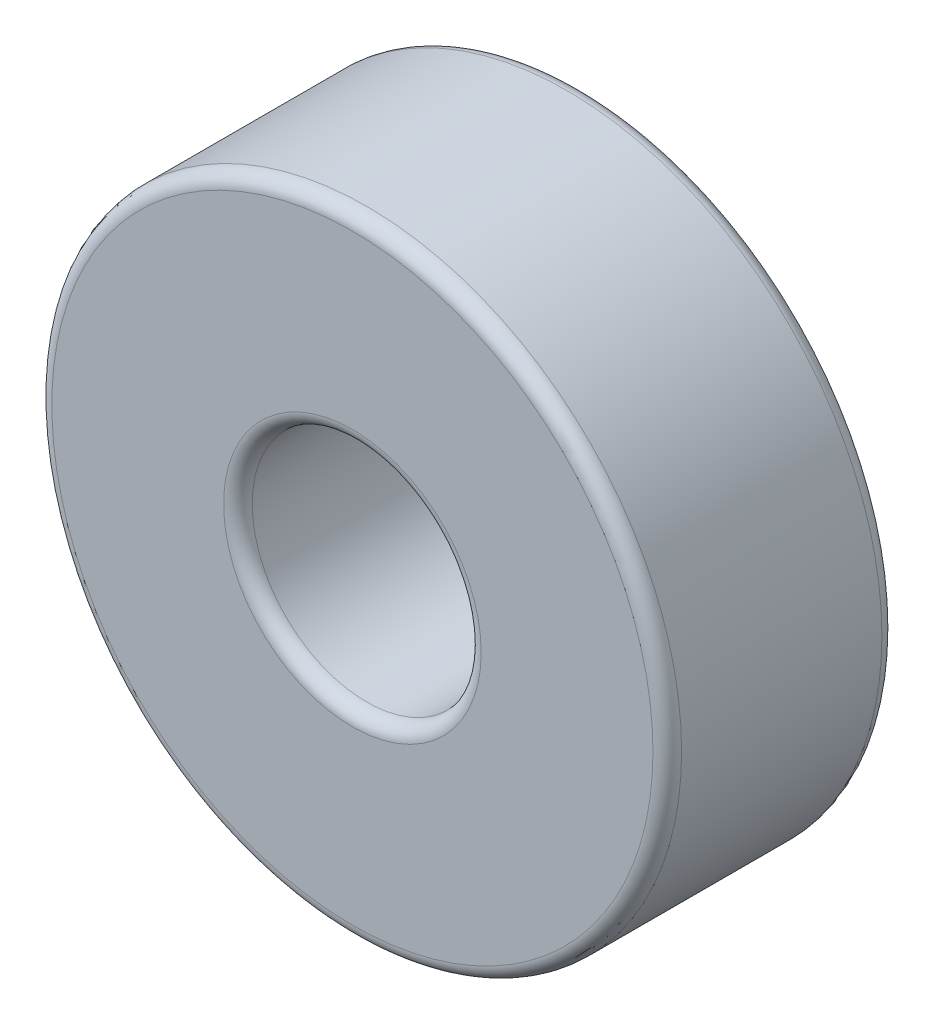
ISO-10303-21;
HEADER;
FILE_DESCRIPTION(('STEP AP214'),'2;1');
FILE_NAME('part.step','',(''),(''),'','','');
FILE_SCHEMA(('AUTOMOTIVE_DESIGN { 1 0 10303 214 1 1 1 1 }'));
ENDSEC;
DATA;
#1=APPLICATION_CONTEXT('core data for automotive mechanical design processes');
#2=APPLICATION_PROTOCOL_DEFINITION('international standard','automotive_design',2000,#1);
#3=PRODUCT_CONTEXT('',#1,'mechanical');
#4=PRODUCT('Part','Part','',(#3));
#5=PRODUCT_RELATED_PRODUCT_CATEGORY('part','',(#4));
#6=PRODUCT_DEFINITION_FORMATION('','',#4);
#7=PRODUCT_DEFINITION_CONTEXT('part definition',#1,'design');
#8=PRODUCT_DEFINITION('design','',#6,#7);
#9=PRODUCT_DEFINITION_SHAPE('','',#8);
#10=(LENGTH_UNIT() NAMED_UNIT(*) SI_UNIT(.MILLI.,.METRE.));
#11=(NAMED_UNIT(*) PLANE_ANGLE_UNIT() SI_UNIT($,.RADIAN.));
#12=(NAMED_UNIT(*) SI_UNIT($,.STERADIAN.) SOLID_ANGLE_UNIT());
#13=UNCERTAINTY_MEASURE_WITH_UNIT(LENGTH_MEASURE(1.E-05),#10,'distance_accuracy_value','');
#14=(GEOMETRIC_REPRESENTATION_CONTEXT(3) GLOBAL_UNCERTAINTY_ASSIGNED_CONTEXT((#13)) GLOBAL_UNIT_ASSIGNED_CONTEXT((#10,
#11,#12)) REPRESENTATION_CONTEXT('',''));
#15=CARTESIAN_POINT('',(0.,0.,0.));
#16=DIRECTION('',(0.,0.,1.));
#17=DIRECTION('',(1.,0.,0.));
#18=AXIS2_PLACEMENT_3D('',#15,#16,#17);
#19=CARTESIAN_POINT('',(0.,0.,8.));
#20=DIRECTION('',(0.,0.,1.));
#21=DIRECTION('',(1.,0.,0.));
#22=AXIS2_PLACEMENT_3D('',#19,#20,#21);
#23=PLANE('',#22);
#24=CARTESIAN_POINT('',(0.,0.,8.));
#25=DIRECTION('',(0.,0.,1.));
#26=DIRECTION('',(1.,0.,0.));
#27=AXIS2_PLACEMENT_3D('',#24,#25,#26);
#28=CIRCLE('',#27,4.5);
#29=CARTESIAN_POINT('',(4.5,0.,8.));
#30=VERTEX_POINT('',#29);
#31=EDGE_CURVE('E40',#30,#30,#28,.F.);
#32=ORIENTED_EDGE('',*,*,#31,.T.);
#33=EDGE_LOOP('',(#32));
#34=FACE_BOUND('',#33,.T.);
#35=CARTESIAN_POINT('',(0.,0.,8.));
#36=DIRECTION('',(0.,0.,1.));
#37=DIRECTION('',(1.,0.,0.));
#38=AXIS2_PLACEMENT_3D('',#35,#36,#37);
#39=CIRCLE('',#38,10.5);
#40=CARTESIAN_POINT('',(10.5,0.,8.));
#41=VERTEX_POINT('',#40);
#42=EDGE_CURVE('E44',#41,#41,#39,.T.);
#43=ORIENTED_EDGE('',*,*,#42,.T.);
#44=EDGE_LOOP('',(#43));
#45=FACE_BOUND('',#44,.T.);
#46=ADVANCED_FACE('F29',(#34,#45),#23,.T.);
#47=CARTESIAN_POINT('',(0.,0.,0.));
#48=DIRECTION('',(0.,0.,1.));
#49=DIRECTION('',(1.,0.,0.));
#50=AXIS2_PLACEMENT_3D('',#47,#48,#49);
#51=PLANE('',#50);
#52=CARTESIAN_POINT('',(0.,0.,0.));
#53=DIRECTION('',(0.,0.,1.));
#54=DIRECTION('',(1.,0.,0.));
#55=AXIS2_PLACEMENT_3D('',#52,#53,#54);
#56=CIRCLE('',#55,4.5);
#57=CARTESIAN_POINT('',(4.5,0.,0.));
#58=VERTEX_POINT('',#57);
#59=EDGE_CURVE('E55',#58,#58,#56,.T.);
#60=ORIENTED_EDGE('',*,*,#59,.T.);
#61=EDGE_LOOP('',(#60));
#62=FACE_BOUND('',#61,.T.);
#63=CARTESIAN_POINT('',(0.,0.,0.));
#64=DIRECTION('',(0.,0.,1.));
#65=DIRECTION('',(1.,0.,0.));
#66=AXIS2_PLACEMENT_3D('',#63,#64,#65);
#67=CIRCLE('',#66,10.5);
#68=CARTESIAN_POINT('',(10.5,0.,0.));
#69=VERTEX_POINT('',#68);
#70=EDGE_CURVE('E58',#69,#69,#67,.F.);
#71=ORIENTED_EDGE('',*,*,#70,.T.);
#72=EDGE_LOOP('',(#71));
#73=FACE_BOUND('',#72,.T.);
#74=ADVANCED_FACE('F62',(#62,#73),#51,.F.);
#75=CARTESIAN_POINT('',(0.,0.,8.));
#76=DIRECTION('',(0.,0.,-1.));
#77=DIRECTION('',(-1.,0.,0.));
#78=AXIS2_PLACEMENT_3D('',#75,#76,#77);
#79=CYLINDRICAL_SURFACE('',#78,11.);
#80=CARTESIAN_POINT('',(0.,0.,0.5));
#81=DIRECTION('',(0.,0.,1.));
#82=DIRECTION('',(1.,0.,0.));
#83=AXIS2_PLACEMENT_3D('',#80,#81,#82);
#84=CIRCLE('',#83,11.);
#85=CARTESIAN_POINT('',(11.,0.,0.5));
#86=VERTEX_POINT('',#85);
#87=EDGE_CURVE('E10',#86,#86,#84,.T.);
#88=ORIENTED_EDGE('',*,*,#87,.T.);
#89=EDGE_LOOP('',(#88));
#90=FACE_BOUND('',#89,.T.);
#91=CARTESIAN_POINT('',(0.,0.,7.5));
#92=DIRECTION('',(0.,0.,1.));
#93=DIRECTION('',(1.,0.,0.));
#94=AXIS2_PLACEMENT_3D('',#91,#92,#93);
#95=CIRCLE('',#94,11.);
#96=CARTESIAN_POINT('',(11.,0.,7.5));
#97=VERTEX_POINT('',#96);
#98=EDGE_CURVE('E36',#97,#97,#95,.F.);
#99=ORIENTED_EDGE('',*,*,#98,.T.);
#100=EDGE_LOOP('',(#99));
#101=FACE_BOUND('',#100,.T.);
#102=ADVANCED_FACE('F82',(#90,#101),#79,.T.);
#103=CARTESIAN_POINT('',(0.,0.,8.));
#104=DIRECTION('',(0.,0.,-1.));
#105=DIRECTION('',(-1.,0.,0.));
#106=AXIS2_PLACEMENT_3D('',#103,#104,#105);
#107=CYLINDRICAL_SURFACE('',#106,4.);
#108=CARTESIAN_POINT('',(0.,0.,0.5));
#109=DIRECTION('',(0.,0.,1.));
#110=DIRECTION('',(1.,0.,0.));
#111=AXIS2_PLACEMENT_3D('',#108,#109,#110);
#112=CIRCLE('',#111,4.);
#113=CARTESIAN_POINT('',(4.,0.,0.5));
#114=VERTEX_POINT('',#113);
#115=EDGE_CURVE('E49',#114,#114,#112,.F.);
#116=ORIENTED_EDGE('',*,*,#115,.T.);
#117=EDGE_LOOP('',(#116));
#118=FACE_BOUND('',#117,.T.);
#119=CARTESIAN_POINT('',(0.,0.,7.5));
#120=DIRECTION('',(0.,0.,1.));
#121=DIRECTION('',(1.,0.,0.));
#122=AXIS2_PLACEMENT_3D('',#119,#120,#121);
#123=CIRCLE('',#122,4.);
#124=CARTESIAN_POINT('',(4.,0.,7.5));
#125=VERTEX_POINT('',#124);
#126=EDGE_CURVE('E52',#125,#125,#123,.T.);
#127=ORIENTED_EDGE('',*,*,#126,.T.);
#128=EDGE_LOOP('',(#127));
#129=FACE_BOUND('',#128,.T.);
#130=ADVANCED_FACE('F87',(#118,#129),#107,.F.);
#131=CARTESIAN_POINT('',(0.,0.,0.5));
#132=DIRECTION('',(0.,0.,1.));
#133=DIRECTION('',(1.,0.,0.));
#134=AXIS2_PLACEMENT_3D('',#131,#132,#133);
#135=TOROIDAL_SURFACE('',#134,4.5,0.5);
#136=ORIENTED_EDGE('',*,*,#115,.F.);
#137=EDGE_LOOP('',(#136));
#138=FACE_BOUND('',#137,.T.);
#139=ORIENTED_EDGE('',*,*,#59,.F.);
#140=EDGE_LOOP('',(#139));
#141=FACE_BOUND('',#140,.T.);
#142=ADVANCED_FACE('F73',(#138,#141),#135,.T.);
#143=CARTESIAN_POINT('',(0.,0.,7.5));
#144=DIRECTION('',(0.,0.,1.));
#145=DIRECTION('',(1.,0.,0.));
#146=AXIS2_PLACEMENT_3D('',#143,#144,#145);
#147=TOROIDAL_SURFACE('',#146,4.5,0.5);
#148=ORIENTED_EDGE('',*,*,#31,.F.);
#149=EDGE_LOOP('',(#148));
#150=FACE_BOUND('',#149,.T.);
#151=ORIENTED_EDGE('',*,*,#126,.F.);
#152=EDGE_LOOP('',(#151));
#153=FACE_BOUND('',#152,.T.);
#154=ADVANCED_FACE('F67',(#150,#153),#147,.T.);
#155=CARTESIAN_POINT('',(0.,0.,0.5));
#156=DIRECTION('',(0.,0.,1.));
#157=DIRECTION('',(1.,0.,0.));
#158=AXIS2_PLACEMENT_3D('',#155,#156,#157);
#159=TOROIDAL_SURFACE('',#158,10.5,0.5);
#160=ORIENTED_EDGE('',*,*,#70,.F.);
#161=EDGE_LOOP('',(#160));
#162=FACE_BOUND('',#161,.T.);
#163=ORIENTED_EDGE('',*,*,#87,.F.);
#164=EDGE_LOOP('',(#163));
#165=FACE_BOUND('',#164,.T.);
#166=ADVANCED_FACE('F64',(#162,#165),#159,.T.);
#167=CARTESIAN_POINT('',(0.,0.,7.5));
#168=DIRECTION('',(0.,0.,1.));
#169=DIRECTION('',(1.,0.,0.));
#170=AXIS2_PLACEMENT_3D('',#167,#168,#169);
#171=TOROIDAL_SURFACE('',#170,10.5,0.5);
#172=ORIENTED_EDGE('',*,*,#98,.F.);
#173=EDGE_LOOP('',(#172));
#174=FACE_BOUND('',#173,.T.);
#175=ORIENTED_EDGE('',*,*,#42,.F.);
#176=EDGE_LOOP('',(#175));
#177=FACE_BOUND('',#176,.T.);
#178=ADVANCED_FACE('F31',(#174,#177),#171,.T.);
#179=CLOSED_SHELL('',(#46,#74,#102,#130,#142,#154,#166,#178));
#180=MANIFOLD_SOLID_BREP('B2',#179);
#181=ADVANCED_BREP_SHAPE_REPRESENTATION('',(#18,#180),#14);
#182=SHAPE_DEFINITION_REPRESENTATION(#9,#181);
ENDSEC;
END-ISO-10303-21;
